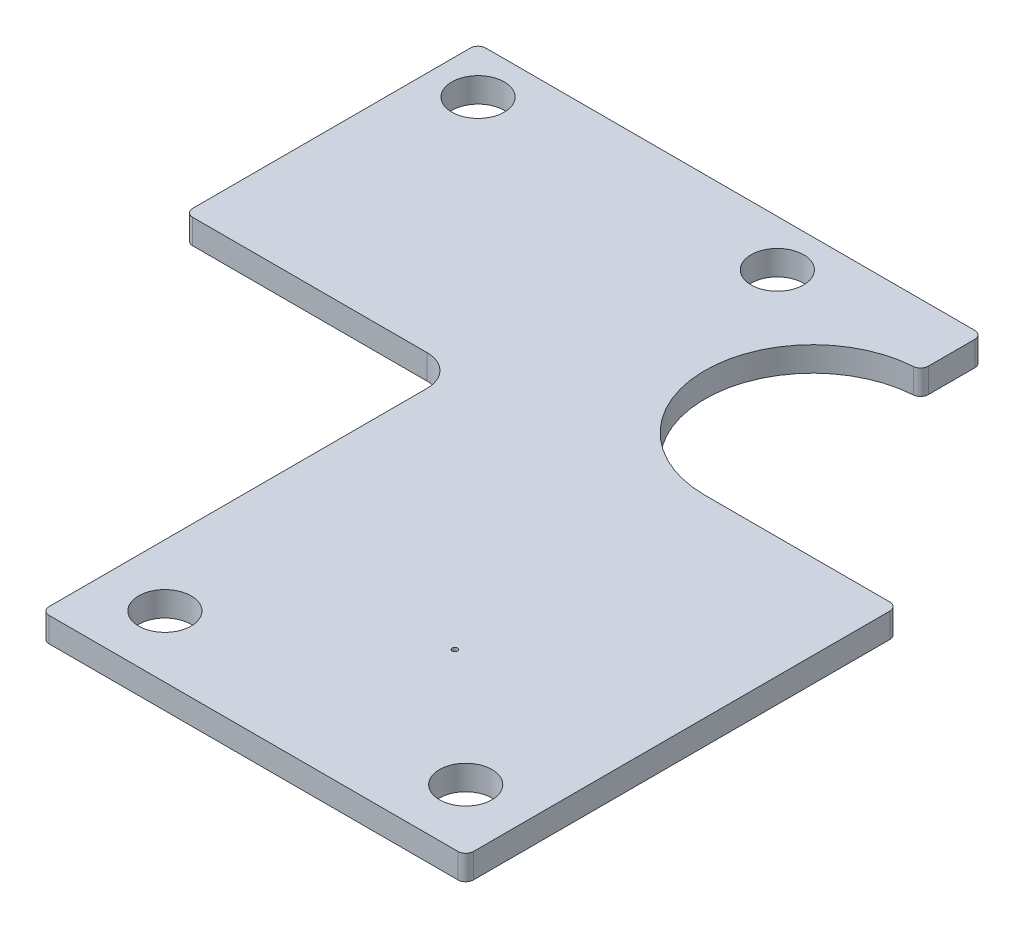
ISO-10303-21;
HEADER;
FILE_DESCRIPTION(('STEP AP214'),'2;1');
FILE_NAME('part.step','',(''),(''),'','','');
FILE_SCHEMA(('AUTOMOTIVE_DESIGN { 1 0 10303 214 1 1 1 1 }'));
ENDSEC;
DATA;
#1=APPLICATION_CONTEXT('core data for automotive mechanical design processes');
#2=APPLICATION_PROTOCOL_DEFINITION('international standard','automotive_design',2000,#1);
#3=PRODUCT_CONTEXT('',#1,'mechanical');
#4=PRODUCT('Part','Part','',(#3));
#5=PRODUCT_RELATED_PRODUCT_CATEGORY('part','',(#4));
#6=PRODUCT_DEFINITION_FORMATION('','',#4);
#7=PRODUCT_DEFINITION_CONTEXT('part definition',#1,'design');
#8=PRODUCT_DEFINITION('design','',#6,#7);
#9=PRODUCT_DEFINITION_SHAPE('','',#8);
#10=(LENGTH_UNIT() NAMED_UNIT(*) SI_UNIT(.MILLI.,.METRE.));
#11=(NAMED_UNIT(*) PLANE_ANGLE_UNIT() SI_UNIT($,.RADIAN.));
#12=(NAMED_UNIT(*) SI_UNIT($,.STERADIAN.) SOLID_ANGLE_UNIT());
#13=UNCERTAINTY_MEASURE_WITH_UNIT(LENGTH_MEASURE(1.E-05),#10,'distance_accuracy_value','');
#14=(GEOMETRIC_REPRESENTATION_CONTEXT(3) GLOBAL_UNCERTAINTY_ASSIGNED_CONTEXT((#13)) GLOBAL_UNIT_ASSIGNED_CONTEXT((#10,
#11,#12)) REPRESENTATION_CONTEXT('',''));
#15=CARTESIAN_POINT('',(0.,0.,0.));
#16=DIRECTION('',(0.,0.,1.));
#17=DIRECTION('',(1.,0.,0.));
#18=AXIS2_PLACEMENT_3D('',#15,#16,#17);
#19=CARTESIAN_POINT('',(0.0325532906366478,1.6,-51.5900827922994));
#20=DIRECTION('',(0.,0.,1.));
#21=DIRECTION('',(1.,0.,0.));
#22=AXIS2_PLACEMENT_3D('',#19,#20,#21);
#23=PLANE('',#22);
#24=DIRECTION('',(-1.,0.,0.));
#25=VECTOR('',#24,1.);
#26=CARTESIAN_POINT('',(0.0325532906366478,0.,-51.5900827922994));
#27=LINE('',#26,#25);
#28=CARTESIAN_POINT('',(32.2325532906362,0.,-51.5900827922994));
#29=VERTEX_POINT('',#28);
#30=CARTESIAN_POINT('',(0.532553290636648,0.,-51.5900827922994));
#31=VERTEX_POINT('',#30);
#32=EDGE_CURVE('E185',#29,#31,#27,.T.);
#33=ORIENTED_EDGE('',*,*,#32,.T.);
#34=DIRECTION('',(0.,-1.,0.));
#35=VECTOR('',#34,1.);
#36=CARTESIAN_POINT('',(0.532553290636648,1.6,-51.5900827922994));
#37=LINE('',#36,#35);
#38=CARTESIAN_POINT('',(0.532553290636648,1.6,-51.5900827922994));
#39=VERTEX_POINT('',#38);
#40=EDGE_CURVE('E250',#31,#39,#37,.F.);
#41=ORIENTED_EDGE('',*,*,#40,.T.);
#42=DIRECTION('',(-1.,0.,0.));
#43=VECTOR('',#42,1.);
#44=CARTESIAN_POINT('',(0.0325532906366478,1.6,-51.5900827922994));
#45=LINE('',#44,#43);
#46=CARTESIAN_POINT('',(32.2325532906362,1.6,-51.5900827922994));
#47=VERTEX_POINT('',#46);
#48=EDGE_CURVE('E207',#47,#39,#45,.T.);
#49=ORIENTED_EDGE('',*,*,#48,.F.);
#50=DIRECTION('',(0.,-1.,0.));
#51=VECTOR('',#50,1.);
#52=CARTESIAN_POINT('',(32.2325532906362,1.6,-51.5900827922994));
#53=LINE('',#52,#51);
#54=EDGE_CURVE('E247',#47,#29,#53,.T.);
#55=ORIENTED_EDGE('',*,*,#54,.T.);
#56=EDGE_LOOP('',(#33,#41,#49,#55));
#57=FACE_BOUND('',#56,.T.);
#58=ADVANCED_FACE('F33',(#57),#23,.F.);
#59=CARTESIAN_POINT('',(0.0325532906366478,1.6,-32.5900827922994));
#60=DIRECTION('',(1.,0.,0.));
#61=DIRECTION('',(0.,0.,-1.));
#62=AXIS2_PLACEMENT_3D('',#59,#60,#61);
#63=PLANE('',#62);
#64=DIRECTION('',(0.,0.,1.));
#65=VECTOR('',#64,1.);
#66=CARTESIAN_POINT('',(0.0325532906366478,1.6,-32.5900827922994));
#67=LINE('',#66,#65);
#68=CARTESIAN_POINT('',(0.0325532906366478,1.6,-51.0900827922994));
#69=VERTEX_POINT('',#68);
#70=CARTESIAN_POINT('',(0.0325532906366478,1.6,-33.0900827922994));
#71=VERTEX_POINT('',#70);
#72=EDGE_CURVE('E300',#69,#71,#67,.T.);
#73=ORIENTED_EDGE('',*,*,#72,.F.);
#74=DIRECTION('',(0.,-1.,0.));
#75=VECTOR('',#74,1.);
#76=CARTESIAN_POINT('',(0.0325532906366478,1.6,-51.0900827922994));
#77=LINE('',#76,#75);
#78=CARTESIAN_POINT('',(0.0325532906366478,0.,-51.0900827922994));
#79=VERTEX_POINT('',#78);
#80=EDGE_CURVE('E244',#69,#79,#77,.T.);
#81=ORIENTED_EDGE('',*,*,#80,.T.);
#82=DIRECTION('',(0.,0.,1.));
#83=VECTOR('',#82,1.);
#84=CARTESIAN_POINT('',(0.0325532906366478,0.,-32.5900827922994));
#85=LINE('',#84,#83);
#86=CARTESIAN_POINT('',(0.0325532906366478,0.,-33.0900827922994));
#87=VERTEX_POINT('',#86);
#88=EDGE_CURVE('E188',#79,#87,#85,.T.);
#89=ORIENTED_EDGE('',*,*,#88,.T.);
#90=DIRECTION('',(0.,-1.,0.));
#91=VECTOR('',#90,1.);
#92=CARTESIAN_POINT('',(0.0325532906366478,1.6,-33.0900827922994));
#93=LINE('',#92,#91);
#94=EDGE_CURVE('E242',#87,#71,#93,.F.);
#95=ORIENTED_EDGE('',*,*,#94,.T.);
#96=EDGE_LOOP('',(#73,#81,#89,#95));
#97=FACE_BOUND('',#96,.T.);
#98=ADVANCED_FACE('F371',(#97),#63,.F.);
#99=CARTESIAN_POINT('',(17.7325532906362,1.6,-32.5900827922994));
#100=DIRECTION('',(0.,0.,-1.));
#101=DIRECTION('',(-1.,0.,0.));
#102=AXIS2_PLACEMENT_3D('',#99,#100,#101);
#103=PLANE('',#102);
#104=DIRECTION('',(1.,0.,0.));
#105=VECTOR('',#104,1.);
#106=CARTESIAN_POINT('',(17.7325532906362,0.,-32.5900827922994));
#107=LINE('',#106,#105);
#108=CARTESIAN_POINT('',(0.532553290636648,0.,-32.5900827922994));
#109=VERTEX_POINT('',#108);
#110=CARTESIAN_POINT('',(15.7325532906362,0.,-32.5900827922994));
#111=VERTEX_POINT('',#110);
#112=EDGE_CURVE('E192',#109,#111,#107,.T.);
#113=ORIENTED_EDGE('',*,*,#112,.T.);
#114=DIRECTION('',(0.,-1.,0.));
#115=VECTOR('',#114,1.);
#116=CARTESIAN_POINT('',(15.7325532906362,1.6,-32.5900827922994));
#117=LINE('',#116,#115);
#118=CARTESIAN_POINT('',(15.7325532906362,1.6,-32.5900827922994));
#119=VERTEX_POINT('',#118);
#120=EDGE_CURVE('E54',#111,#119,#117,.F.);
#121=ORIENTED_EDGE('',*,*,#120,.T.);
#122=DIRECTION('',(1.,0.,0.));
#123=VECTOR('',#122,1.);
#124=CARTESIAN_POINT('',(17.7325532906362,1.6,-32.5900827922994));
#125=LINE('',#124,#123);
#126=CARTESIAN_POINT('',(0.532553290636648,1.6,-32.5900827922994));
#127=VERTEX_POINT('',#126);
#128=EDGE_CURVE('E296',#127,#119,#125,.T.);
#129=ORIENTED_EDGE('',*,*,#128,.F.);
#130=DIRECTION('',(0.,-1.,0.));
#131=VECTOR('',#130,1.);
#132=CARTESIAN_POINT('',(0.532553290636648,1.6,-32.5900827922994));
#133=LINE('',#132,#131);
#134=EDGE_CURVE('E252',#127,#109,#133,.T.);
#135=ORIENTED_EDGE('',*,*,#134,.T.);
#136=EDGE_LOOP('',(#113,#121,#129,#135));
#137=FACE_BOUND('',#136,.T.);
#138=ADVANCED_FACE('F377',(#137),#103,.F.);
#139=CARTESIAN_POINT('',(17.7325532906362,1.6,-5.59008279229901));
#140=DIRECTION('',(1.,0.,0.));
#141=DIRECTION('',(0.,0.,-1.));
#142=AXIS2_PLACEMENT_3D('',#139,#140,#141);
#143=PLANE('',#142);
#144=DIRECTION('',(0.,0.,1.));
#145=VECTOR('',#144,1.);
#146=CARTESIAN_POINT('',(17.7325532906362,1.6,-5.59008279229901));
#147=LINE('',#146,#145);
#148=CARTESIAN_POINT('',(17.7325532906362,1.6,-30.5900827922994));
#149=VERTEX_POINT('',#148);
#150=CARTESIAN_POINT('',(17.7325532906362,1.6,-6.09008279229901));
#151=VERTEX_POINT('',#150);
#152=EDGE_CURVE('E277',#149,#151,#147,.T.);
#153=ORIENTED_EDGE('',*,*,#152,.F.);
#154=DIRECTION('',(0.,-1.,0.));
#155=VECTOR('',#154,1.);
#156=CARTESIAN_POINT('',(17.7325532906362,0.,-30.5900827922994));
#157=LINE('',#156,#155);
#158=CARTESIAN_POINT('',(17.7325532906362,0.,-30.5900827922994));
#159=VERTEX_POINT('',#158);
#160=EDGE_CURVE('E270',#149,#159,#157,.T.);
#161=ORIENTED_EDGE('',*,*,#160,.T.);
#162=DIRECTION('',(0.,0.,1.));
#163=VECTOR('',#162,1.);
#164=CARTESIAN_POINT('',(17.7325532906362,0.,-5.59008279229901));
#165=LINE('',#164,#163);
#166=CARTESIAN_POINT('',(17.7325532906362,0.,-6.09008279229901));
#167=VERTEX_POINT('',#166);
#168=EDGE_CURVE('E194',#159,#167,#165,.T.);
#169=ORIENTED_EDGE('',*,*,#168,.T.);
#170=DIRECTION('',(0.,-1.,0.));
#171=VECTOR('',#170,1.);
#172=CARTESIAN_POINT('',(17.7325532906362,1.6,-6.09008279229901));
#173=LINE('',#172,#171);
#174=EDGE_CURVE('E267',#167,#151,#173,.F.);
#175=ORIENTED_EDGE('',*,*,#174,.T.);
#176=EDGE_LOOP('',(#153,#161,#169,#175));
#177=FACE_BOUND('',#176,.T.);
#178=ADVANCED_FACE('F276',(#177),#143,.F.);
#179=CARTESIAN_POINT('',(45.2325532906362,1.6,-5.59008279229901));
#180=DIRECTION('',(0.,0.,-1.));
#181=DIRECTION('',(-1.,0.,0.));
#182=AXIS2_PLACEMENT_3D('',#179,#180,#181);
#183=PLANE('',#182);
#184=DIRECTION('',(1.,0.,0.));
#185=VECTOR('',#184,1.);
#186=CARTESIAN_POINT('',(45.2325532906362,1.6,-5.59008279229901));
#187=LINE('',#186,#185);
#188=CARTESIAN_POINT('',(18.2325532906362,1.6,-5.59008279229901));
#189=VERTEX_POINT('',#188);
#190=CARTESIAN_POINT('',(44.7325532906362,1.6,-5.59008279229901));
#191=VERTEX_POINT('',#190);
#192=EDGE_CURVE('E290',#189,#191,#187,.T.);
#193=ORIENTED_EDGE('',*,*,#192,.F.);
#194=DIRECTION('',(0.,-1.,0.));
#195=VECTOR('',#194,1.);
#196=CARTESIAN_POINT('',(18.2325532906362,1.6,-5.59008279229901));
#197=LINE('',#196,#195);
#198=CARTESIAN_POINT('',(18.2325532906362,0.,-5.59008279229901));
#199=VERTEX_POINT('',#198);
#200=EDGE_CURVE('E264',#189,#199,#197,.T.);
#201=ORIENTED_EDGE('',*,*,#200,.T.);
#202=DIRECTION('',(1.,0.,0.));
#203=VECTOR('',#202,1.);
#204=CARTESIAN_POINT('',(45.2325532906362,0.,-5.59008279229901));
#205=LINE('',#204,#203);
#206=CARTESIAN_POINT('',(44.7325532906362,0.,-5.59008279229901));
#207=VERTEX_POINT('',#206);
#208=EDGE_CURVE('E196',#199,#207,#205,.T.);
#209=ORIENTED_EDGE('',*,*,#208,.T.);
#210=DIRECTION('',(0.,-1.,0.));
#211=VECTOR('',#210,1.);
#212=CARTESIAN_POINT('',(44.7325532906362,1.6,-5.59008279229901));
#213=LINE('',#212,#211);
#214=EDGE_CURVE('E262',#207,#191,#213,.F.);
#215=ORIENTED_EDGE('',*,*,#214,.T.);
#216=EDGE_LOOP('',(#193,#201,#209,#215));
#217=FACE_BOUND('',#216,.T.);
#218=ADVANCED_FACE('F293',(#217),#183,.F.);
#219=CARTESIAN_POINT('',(45.2325532906362,1.6,-33.590082792299));
#220=DIRECTION('',(-1.,0.,0.));
#221=DIRECTION('',(0.,0.,1.));
#222=AXIS2_PLACEMENT_3D('',#219,#220,#221);
#223=PLANE('',#222);
#224=DIRECTION('',(0.,0.,-1.));
#225=VECTOR('',#224,1.);
#226=CARTESIAN_POINT('',(45.2325532906362,0.,-33.590082792299));
#227=LINE('',#226,#225);
#228=CARTESIAN_POINT('',(45.2325532906362,0.,-6.09008279229902));
#229=VERTEX_POINT('',#228);
#230=CARTESIAN_POINT('',(45.2325532906362,0.,-33.090082792299));
#231=VERTEX_POINT('',#230);
#232=EDGE_CURVE('E199',#229,#231,#227,.T.);
#233=ORIENTED_EDGE('',*,*,#232,.T.);
#234=DIRECTION('',(0.,-1.,0.));
#235=VECTOR('',#234,1.);
#236=CARTESIAN_POINT('',(45.2325532906362,1.6,-33.090082792299));
#237=LINE('',#236,#235);
#238=CARTESIAN_POINT('',(45.2325532906362,1.6,-33.090082792299));
#239=VERTEX_POINT('',#238);
#240=EDGE_CURVE('E260',#231,#239,#237,.F.);
#241=ORIENTED_EDGE('',*,*,#240,.T.);
#242=DIRECTION('',(0.,0.,-1.));
#243=VECTOR('',#242,1.);
#244=CARTESIAN_POINT('',(45.2325532906362,1.6,-33.590082792299));
#245=LINE('',#244,#243);
#246=CARTESIAN_POINT('',(45.2325532906362,1.6,-6.09008279229902));
#247=VERTEX_POINT('',#246);
#248=EDGE_CURVE('E164',#247,#239,#245,.T.);
#249=ORIENTED_EDGE('',*,*,#248,.F.);
#250=DIRECTION('',(0.,-1.,0.));
#251=VECTOR('',#250,1.);
#252=CARTESIAN_POINT('',(45.2325532906362,1.6,-6.09008279229901));
#253=LINE('',#252,#251);
#254=EDGE_CURVE('E257',#247,#229,#253,.T.);
#255=ORIENTED_EDGE('',*,*,#254,.T.);
#256=EDGE_LOOP('',(#233,#241,#249,#255));
#257=FACE_BOUND('',#256,.T.);
#258=ADVANCED_FACE('F410',(#257),#223,.F.);
#259=CARTESIAN_POINT('',(32.7325532906362,1.6,-33.590082792299));
#260=DIRECTION('',(0.,0.,1.));
#261=DIRECTION('',(1.,0.,0.));
#262=AXIS2_PLACEMENT_3D('',#259,#260,#261);
#263=PLANE('',#262);
#264=DIRECTION('',(-1.,0.,0.));
#265=VECTOR('',#264,1.);
#266=CARTESIAN_POINT('',(32.7325532906362,1.6,-33.590082792299));
#267=LINE('',#266,#265);
#268=CARTESIAN_POINT('',(44.7325532906362,1.6,-33.590082792299));
#269=VERTEX_POINT('',#268);
#270=CARTESIAN_POINT('',(32.7325532906362,1.6,-33.590082792299));
#271=VERTEX_POINT('',#270);
#272=EDGE_CURVE('E152',#269,#271,#267,.T.);
#273=ORIENTED_EDGE('',*,*,#272,.F.);
#274=DIRECTION('',(0.,-1.,0.));
#275=VECTOR('',#274,1.);
#276=CARTESIAN_POINT('',(44.7325532906362,1.6,-33.590082792299));
#277=LINE('',#276,#275);
#278=CARTESIAN_POINT('',(44.7325532906362,0.,-33.590082792299));
#279=VERTEX_POINT('',#278);
#280=EDGE_CURVE('E255',#269,#279,#277,.T.);
#281=ORIENTED_EDGE('',*,*,#280,.T.);
#282=DIRECTION('',(-1.,0.,0.));
#283=VECTOR('',#282,1.);
#284=CARTESIAN_POINT('',(32.7325532906362,0.,-33.590082792299));
#285=LINE('',#284,#283);
#286=CARTESIAN_POINT('',(32.7325532906362,0.,-33.590082792299));
#287=VERTEX_POINT('',#286);
#288=EDGE_CURVE('E170',#279,#287,#285,.T.);
#289=ORIENTED_EDGE('',*,*,#288,.T.);
#290=DIRECTION('',(0.,-1.,0.));
#291=VECTOR('',#290,1.);
#292=CARTESIAN_POINT('',(32.7325532906362,1.6,-33.590082792299));
#293=LINE('',#292,#291);
#294=EDGE_CURVE('E167',#271,#287,#293,.T.);
#295=ORIENTED_EDGE('',*,*,#294,.F.);
#296=EDGE_LOOP('',(#273,#281,#289,#295));
#297=FACE_BOUND('',#296,.T.);
#298=ADVANCED_FACE('F168',(#297),#263,.F.);
#299=CARTESIAN_POINT('',(32.7325532906362,1.6,-40.590082792299));
#300=DIRECTION('',(0.,-1.,0.));
#301=DIRECTION('',(0.,0.,-1.));
#302=AXIS2_PLACEMENT_3D('',#299,#300,#301);
#303=CYLINDRICAL_SURFACE('',#302,7.);
#304=CARTESIAN_POINT('',(32.7325532906362,0.,-40.590082792299));
#305=DIRECTION('',(0.,-1.,0.));
#306=DIRECTION('',(0.,0.,1.));
#307=AXIS2_PLACEMENT_3D('',#304,#305,#306);
#308=CIRCLE('',#307,7.);
#309=CARTESIAN_POINT('',(32.2658866239696,0.,-47.5745099142771));
#310=VERTEX_POINT('',#309);
#311=EDGE_CURVE('E203',#287,#310,#308,.T.);
#312=ORIENTED_EDGE('',*,*,#311,.T.);
#313=DIRECTION('',(0.,-1.,0.));
#314=VECTOR('',#313,1.);
#315=CARTESIAN_POINT('',(32.2658866239696,1.6,-47.5745099142771));
#316=LINE('',#315,#314);
#317=CARTESIAN_POINT('',(32.2658866239696,1.6,-47.5745099142771));
#318=VERTEX_POINT('',#317);
#319=EDGE_CURVE('E179',#310,#318,#316,.F.);
#320=ORIENTED_EDGE('',*,*,#319,.T.);
#321=CARTESIAN_POINT('',(32.7325532906362,1.6,-40.590082792299));
#322=DIRECTION('',(0.,-1.,0.));
#323=DIRECTION('',(0.,0.,1.));
#324=AXIS2_PLACEMENT_3D('',#321,#322,#323);
#325=CIRCLE('',#324,7.);
#326=EDGE_CURVE('E156',#271,#318,#325,.T.);
#327=ORIENTED_EDGE('',*,*,#326,.F.);
#328=ORIENTED_EDGE('',*,*,#294,.T.);
#329=EDGE_LOOP('',(#312,#320,#327,#328));
#330=FACE_BOUND('',#329,.T.);
#331=ADVANCED_FACE('F177',(#330),#303,.F.);
#332=CARTESIAN_POINT('',(32.7325532906362,1.6,-47.590082792299));
#333=DIRECTION('',(-1.,0.,0.));
#334=DIRECTION('',(0.,0.,1.));
#335=AXIS2_PLACEMENT_3D('',#332,#333,#334);
#336=PLANE('',#335);
#337=DIRECTION('',(0.,0.,-1.));
#338=VECTOR('',#337,1.);
#339=CARTESIAN_POINT('',(32.7325532906362,1.6,-47.590082792299));
#340=LINE('',#339,#338);
#341=CARTESIAN_POINT('',(32.7325532906362,1.6,-48.0733975658469));
#342=VERTEX_POINT('',#341);
#343=CARTESIAN_POINT('',(32.7325532906362,1.6,-51.0900827922994));
#344=VERTEX_POINT('',#343);
#345=EDGE_CURVE('E175',#342,#344,#340,.T.);
#346=ORIENTED_EDGE('',*,*,#345,.F.);
#347=DIRECTION('',(0.,-1.,0.));
#348=VECTOR('',#347,1.);
#349=CARTESIAN_POINT('',(32.7325532906362,1.6,-48.0733975658469));
#350=LINE('',#349,#348);
#351=CARTESIAN_POINT('',(32.7325532906362,0.,-48.0733975658469));
#352=VERTEX_POINT('',#351);
#353=EDGE_CURVE('E210',#342,#352,#350,.T.);
#354=ORIENTED_EDGE('',*,*,#353,.T.);
#355=DIRECTION('',(0.,0.,-1.));
#356=VECTOR('',#355,1.);
#357=CARTESIAN_POINT('',(32.7325532906362,0.,-47.590082792299));
#358=LINE('',#357,#356);
#359=CARTESIAN_POINT('',(32.7325532906362,0.,-51.0900827922994));
#360=VERTEX_POINT('',#359);
#361=EDGE_CURVE('E205',#352,#360,#358,.T.);
#362=ORIENTED_EDGE('',*,*,#361,.T.);
#363=DIRECTION('',(0.,-1.,0.));
#364=VECTOR('',#363,1.);
#365=CARTESIAN_POINT('',(32.7325532906362,1.6,-51.0900827922994));
#366=LINE('',#365,#364);
#367=EDGE_CURVE('E174',#360,#344,#366,.F.);
#368=ORIENTED_EDGE('',*,*,#367,.T.);
#369=EDGE_LOOP('',(#346,#354,#362,#368));
#370=FACE_BOUND('',#369,.T.);
#371=ADVANCED_FACE('F346',(#370),#336,.F.);
#372=CARTESIAN_POINT('',(32.7325532906362,1.6,-40.590082792299));
#373=DIRECTION('',(0.,1.,0.));
#374=DIRECTION('',(0.,0.,1.));
#375=AXIS2_PLACEMENT_3D('',#372,#373,#374);
#376=PLANE('',#375);
#377=CARTESIAN_POINT('',(33.2975578252259,1.6,-16.8250782577094));
#378=DIRECTION('',(0.,1.,0.));
#379=DIRECTION('',(0.,0.,1.));
#380=AXIS2_PLACEMENT_3D('',#377,#378,#379);
#381=CIRCLE('',#380,0.174999999999996);
#382=CARTESIAN_POINT('',(33.2975578252259,1.6,-16.6500782577094));
#383=VERTEX_POINT('',#382);
#384=EDGE_CURVE('E329',#383,#383,#381,.T.);
#385=ORIENTED_EDGE('',*,*,#384,.F.);
#386=EDGE_LOOP('',(#385));
#387=FACE_BOUND('',#386,.T.);
#388=CARTESIAN_POINT('',(3.03255329063665,1.6,-48.5900827922994));
#389=DIRECTION('',(0.,1.,0.));
#390=DIRECTION('',(0.,0.,1.));
#391=AXIS2_PLACEMENT_3D('',#388,#389,#390);
#392=CIRCLE('',#391,1.7);
#393=CARTESIAN_POINT('',(3.03255329063665,1.6,-46.8900827922994));
#394=VERTEX_POINT('',#393);
#395=EDGE_CURVE('E325',#394,#394,#392,.T.);
#396=ORIENTED_EDGE('',*,*,#395,.F.);
#397=EDGE_LOOP('',(#396));
#398=FACE_BOUND('',#397,.T.);
#399=CARTESIAN_POINT('',(22.4325532906366,1.6,-48.5900827922994));
#400=DIRECTION('',(0.,1.,0.));
#401=DIRECTION('',(0.,0.,1.));
#402=AXIS2_PLACEMENT_3D('',#399,#400,#401);
#403=CIRCLE('',#402,1.7);
#404=CARTESIAN_POINT('',(22.4325532906366,1.6,-46.8900827922994));
#405=VERTEX_POINT('',#404);
#406=EDGE_CURVE('E319',#405,#405,#403,.T.);
#407=ORIENTED_EDGE('',*,*,#406,.F.);
#408=EDGE_LOOP('',(#407));
#409=FACE_BOUND('',#408,.T.);
#410=CARTESIAN_POINT('',(21.7325532906362,1.6,-9.59008279229901));
#411=DIRECTION('',(0.,1.,0.));
#412=DIRECTION('',(0.,0.,1.));
#413=AXIS2_PLACEMENT_3D('',#410,#411,#412);
#414=CIRCLE('',#413,1.7);
#415=CARTESIAN_POINT('',(21.7325532906362,1.6,-7.89008279229901));
#416=VERTEX_POINT('',#415);
#417=EDGE_CURVE('E313',#416,#416,#414,.T.);
#418=ORIENTED_EDGE('',*,*,#417,.F.);
#419=EDGE_LOOP('',(#418));
#420=FACE_BOUND('',#419,.T.);
#421=CARTESIAN_POINT('',(41.2325532906362,1.6,-9.59008279229901));
#422=DIRECTION('',(0.,1.,0.));
#423=DIRECTION('',(0.,0.,1.));
#424=AXIS2_PLACEMENT_3D('',#421,#422,#423);
#425=CIRCLE('',#424,1.7);
#426=CARTESIAN_POINT('',(41.2325532906362,1.6,-7.89008279229901));
#427=VERTEX_POINT('',#426);
#428=EDGE_CURVE('E307',#427,#427,#425,.T.);
#429=ORIENTED_EDGE('',*,*,#428,.F.);
#430=EDGE_LOOP('',(#429));
#431=FACE_BOUND('',#430,.T.);
#432=ORIENTED_EDGE('',*,*,#326,.T.);
#433=CARTESIAN_POINT('',(32.2325532906362,1.6,-48.0733975658469));
#434=DIRECTION('',(0.,1.,0.));
#435=DIRECTION('',(0.,0.,1.));
#436=AXIS2_PLACEMENT_3D('',#433,#434,#435);
#437=CIRCLE('',#436,0.5);
#438=EDGE_CURVE('E240',#318,#342,#437,.T.);
#439=ORIENTED_EDGE('',*,*,#438,.T.);
#440=ORIENTED_EDGE('',*,*,#345,.T.);
#441=CARTESIAN_POINT('',(32.2325532906362,1.6,-51.0900827922994));
#442=DIRECTION('',(0.,1.,0.));
#443=DIRECTION('',(0.,0.,1.));
#444=AXIS2_PLACEMENT_3D('',#441,#442,#443);
#445=CIRCLE('',#444,0.5);
#446=EDGE_CURVE('E234',#344,#47,#445,.T.);
#447=ORIENTED_EDGE('',*,*,#446,.T.);
#448=ORIENTED_EDGE('',*,*,#48,.T.);
#449=CARTESIAN_POINT('',(0.532553290636648,1.6,-51.0900827922994));
#450=DIRECTION('',(0.,1.,0.));
#451=DIRECTION('',(0.,0.,1.));
#452=AXIS2_PLACEMENT_3D('',#449,#450,#451);
#453=CIRCLE('',#452,0.5);
#454=EDGE_CURVE('E238',#39,#69,#453,.T.);
#455=ORIENTED_EDGE('',*,*,#454,.T.);
#456=ORIENTED_EDGE('',*,*,#72,.T.);
#457=CARTESIAN_POINT('',(0.532553290636648,1.6,-33.0900827922994));
#458=DIRECTION('',(0.,1.,0.));
#459=DIRECTION('',(0.,0.,1.));
#460=AXIS2_PLACEMENT_3D('',#457,#458,#459);
#461=CIRCLE('',#460,0.5);
#462=EDGE_CURVE('E236',#71,#127,#461,.T.);
#463=ORIENTED_EDGE('',*,*,#462,.T.);
#464=ORIENTED_EDGE('',*,*,#128,.T.);
#465=CARTESIAN_POINT('',(15.7325532906362,1.6,-30.5900827922994));
#466=DIRECTION('',(0.,1.,0.));
#467=DIRECTION('',(0.,0.,1.));
#468=AXIS2_PLACEMENT_3D('',#465,#466,#467);
#469=CIRCLE('',#468,2.);
#470=EDGE_CURVE('E11',#119,#149,#469,.F.);
#471=ORIENTED_EDGE('',*,*,#470,.T.);
#472=ORIENTED_EDGE('',*,*,#152,.T.);
#473=CARTESIAN_POINT('',(18.2325532906362,1.6,-6.09008279229901));
#474=DIRECTION('',(0.,1.,0.));
#475=DIRECTION('',(0.,0.,1.));
#476=AXIS2_PLACEMENT_3D('',#473,#474,#475);
#477=CIRCLE('',#476,0.5);
#478=EDGE_CURVE('E231',#151,#189,#477,.T.);
#479=ORIENTED_EDGE('',*,*,#478,.T.);
#480=ORIENTED_EDGE('',*,*,#192,.T.);
#481=CARTESIAN_POINT('',(44.7325532906362,1.6,-6.09008279229901));
#482=DIRECTION('',(0.,1.,0.));
#483=DIRECTION('',(0.,0.,1.));
#484=AXIS2_PLACEMENT_3D('',#481,#482,#483);
#485=CIRCLE('',#484,0.5);
#486=EDGE_CURVE('E229',#191,#247,#485,.T.);
#487=ORIENTED_EDGE('',*,*,#486,.T.);
#488=ORIENTED_EDGE('',*,*,#248,.T.);
#489=CARTESIAN_POINT('',(44.7325532906362,1.6,-33.090082792299));
#490=DIRECTION('',(0.,1.,0.));
#491=DIRECTION('',(0.,0.,1.));
#492=AXIS2_PLACEMENT_3D('',#489,#490,#491);
#493=CIRCLE('',#492,0.5);
#494=EDGE_CURVE('E160',#239,#269,#493,.T.);
#495=ORIENTED_EDGE('',*,*,#494,.T.);
#496=ORIENTED_EDGE('',*,*,#272,.T.);
#497=EDGE_LOOP('',(#432,#439,#440,#447,#448,#455,#456,#463,#464,#471,#472,#479,#480,#487,#488,
#495,#496));
#498=FACE_BOUND('',#497,.T.);
#499=ADVANCED_FACE('F154',(#387,#398,#409,#420,#431,#498),#376,.T.);
#500=CARTESIAN_POINT('',(32.7325532906362,0.,-40.590082792299));
#501=DIRECTION('',(0.,1.,0.));
#502=DIRECTION('',(0.,0.,1.));
#503=AXIS2_PLACEMENT_3D('',#500,#501,#502);
#504=PLANE('',#503);
#505=CARTESIAN_POINT('',(33.2975578252259,0.,-16.8250782577094));
#506=DIRECTION('',(0.,1.,0.));
#507=DIRECTION('',(0.,0.,1.));
#508=AXIS2_PLACEMENT_3D('',#505,#506,#507);
#509=CIRCLE('',#508,0.174999999999996);
#510=CARTESIAN_POINT('',(33.2975578252259,0.,-16.6500782577094));
#511=VERTEX_POINT('',#510);
#512=EDGE_CURVE('E328',#511,#511,#509,.T.);
#513=ORIENTED_EDGE('',*,*,#512,.T.);
#514=EDGE_LOOP('',(#513));
#515=FACE_BOUND('',#514,.T.);
#516=CARTESIAN_POINT('',(3.03255329063665,0.,-48.5900827922994));
#517=DIRECTION('',(0.,1.,0.));
#518=DIRECTION('',(0.,0.,1.));
#519=AXIS2_PLACEMENT_3D('',#516,#517,#518);
#520=CIRCLE('',#519,1.7);
#521=CARTESIAN_POINT('',(3.03255329063665,0.,-46.8900827922994));
#522=VERTEX_POINT('',#521);
#523=EDGE_CURVE('E322',#522,#522,#520,.T.);
#524=ORIENTED_EDGE('',*,*,#523,.T.);
#525=EDGE_LOOP('',(#524));
#526=FACE_BOUND('',#525,.T.);
#527=CARTESIAN_POINT('',(22.4325532906366,0.,-48.5900827922994));
#528=DIRECTION('',(0.,1.,0.));
#529=DIRECTION('',(0.,0.,1.));
#530=AXIS2_PLACEMENT_3D('',#527,#528,#529);
#531=CIRCLE('',#530,1.7);
#532=CARTESIAN_POINT('',(22.4325532906366,0.,-46.8900827922994));
#533=VERTEX_POINT('',#532);
#534=EDGE_CURVE('E316',#533,#533,#531,.T.);
#535=ORIENTED_EDGE('',*,*,#534,.T.);
#536=EDGE_LOOP('',(#535));
#537=FACE_BOUND('',#536,.T.);
#538=CARTESIAN_POINT('',(21.7325532906362,0.,-9.59008279229901));
#539=DIRECTION('',(0.,1.,0.));
#540=DIRECTION('',(0.,0.,1.));
#541=AXIS2_PLACEMENT_3D('',#538,#539,#540);
#542=CIRCLE('',#541,1.7);
#543=CARTESIAN_POINT('',(21.7325532906362,0.,-7.89008279229901));
#544=VERTEX_POINT('',#543);
#545=EDGE_CURVE('E310',#544,#544,#542,.T.);
#546=ORIENTED_EDGE('',*,*,#545,.T.);
#547=EDGE_LOOP('',(#546));
#548=FACE_BOUND('',#547,.T.);
#549=CARTESIAN_POINT('',(41.2325532906362,0.,-9.59008279229901));
#550=DIRECTION('',(0.,1.,0.));
#551=DIRECTION('',(0.,0.,1.));
#552=AXIS2_PLACEMENT_3D('',#549,#550,#551);
#553=CIRCLE('',#552,1.7);
#554=CARTESIAN_POINT('',(41.2325532906362,0.,-7.89008279229901));
#555=VERTEX_POINT('',#554);
#556=EDGE_CURVE('E189',#555,#555,#553,.T.);
#557=ORIENTED_EDGE('',*,*,#556,.T.);
#558=EDGE_LOOP('',(#557));
#559=FACE_BOUND('',#558,.T.);
#560=ORIENTED_EDGE('',*,*,#361,.F.);
#561=CARTESIAN_POINT('',(32.2325532906362,0.,-48.0733975658469));
#562=DIRECTION('',(0.,1.,0.));
#563=DIRECTION('',(0.,0.,1.));
#564=AXIS2_PLACEMENT_3D('',#561,#562,#563);
#565=CIRCLE('',#564,0.5);
#566=EDGE_CURVE('E226',#352,#310,#565,.F.);
#567=ORIENTED_EDGE('',*,*,#566,.T.);
#568=ORIENTED_EDGE('',*,*,#311,.F.);
#569=ORIENTED_EDGE('',*,*,#288,.F.);
#570=CARTESIAN_POINT('',(44.7325532906362,0.,-33.090082792299));
#571=DIRECTION('',(0.,1.,0.));
#572=DIRECTION('',(0.,0.,1.));
#573=AXIS2_PLACEMENT_3D('',#570,#571,#572);
#574=CIRCLE('',#573,0.5);
#575=EDGE_CURVE('E218',#279,#231,#574,.F.);
#576=ORIENTED_EDGE('',*,*,#575,.T.);
#577=ORIENTED_EDGE('',*,*,#232,.F.);
#578=CARTESIAN_POINT('',(44.7325532906362,0.,-6.09008279229901));
#579=DIRECTION('',(0.,1.,0.));
#580=DIRECTION('',(0.,0.,1.));
#581=AXIS2_PLACEMENT_3D('',#578,#579,#580);
#582=CIRCLE('',#581,0.5);
#583=EDGE_CURVE('E213',#229,#207,#582,.F.);
#584=ORIENTED_EDGE('',*,*,#583,.T.);
#585=ORIENTED_EDGE('',*,*,#208,.F.);
#586=CARTESIAN_POINT('',(18.2325532906362,0.,-6.09008279229901));
#587=DIRECTION('',(0.,1.,0.));
#588=DIRECTION('',(0.,0.,1.));
#589=AXIS2_PLACEMENT_3D('',#586,#587,#588);
#590=CIRCLE('',#589,0.5);
#591=EDGE_CURVE('E215',#199,#167,#590,.F.);
#592=ORIENTED_EDGE('',*,*,#591,.T.);
#593=ORIENTED_EDGE('',*,*,#168,.F.);
#594=CARTESIAN_POINT('',(15.7325532906362,0.,-30.5900827922994));
#595=DIRECTION('',(0.,1.,0.));
#596=DIRECTION('',(0.,0.,1.));
#597=AXIS2_PLACEMENT_3D('',#594,#595,#596);
#598=CIRCLE('',#597,2.);
#599=EDGE_CURVE('E41',#159,#111,#598,.T.);
#600=ORIENTED_EDGE('',*,*,#599,.T.);
#601=ORIENTED_EDGE('',*,*,#112,.F.);
#602=CARTESIAN_POINT('',(0.532553290636648,0.,-33.0900827922994));
#603=DIRECTION('',(0.,1.,0.));
#604=DIRECTION('',(0.,0.,1.));
#605=AXIS2_PLACEMENT_3D('',#602,#603,#604);
#606=CIRCLE('',#605,0.5);
#607=EDGE_CURVE('E222',#109,#87,#606,.F.);
#608=ORIENTED_EDGE('',*,*,#607,.T.);
#609=ORIENTED_EDGE('',*,*,#88,.F.);
#610=CARTESIAN_POINT('',(0.532553290636648,0.,-51.0900827922994));
#611=DIRECTION('',(0.,1.,0.));
#612=DIRECTION('',(0.,0.,1.));
#613=AXIS2_PLACEMENT_3D('',#610,#611,#612);
#614=CIRCLE('',#613,0.5);
#615=EDGE_CURVE('E224',#79,#31,#614,.F.);
#616=ORIENTED_EDGE('',*,*,#615,.T.);
#617=ORIENTED_EDGE('',*,*,#32,.F.);
#618=CARTESIAN_POINT('',(32.2325532906362,0.,-51.0900827922994));
#619=DIRECTION('',(0.,1.,0.));
#620=DIRECTION('',(0.,0.,1.));
#621=AXIS2_PLACEMENT_3D('',#618,#619,#620);
#622=CIRCLE('',#621,0.5);
#623=EDGE_CURVE('E220',#29,#360,#622,.F.);
#624=ORIENTED_EDGE('',*,*,#623,.T.);
#625=EDGE_LOOP('',(#560,#567,#568,#569,#576,#577,#584,#585,#592,#593,#600,#601,#608,#609,#616,
#617,#624));
#626=FACE_BOUND('',#625,.T.);
#627=ADVANCED_FACE('F281',(#515,#526,#537,#548,#559,#626),#504,.F.);
#628=CARTESIAN_POINT('',(32.2325532906362,1.6,-48.0733975658469));
#629=DIRECTION('',(0.,-1.,0.));
#630=DIRECTION('',(0.,0.,-1.));
#631=AXIS2_PLACEMENT_3D('',#628,#629,#630);
#632=CYLINDRICAL_SURFACE('',#631,0.5);
#633=ORIENTED_EDGE('',*,*,#438,.F.);
#634=ORIENTED_EDGE('',*,*,#319,.F.);
#635=ORIENTED_EDGE('',*,*,#566,.F.);
#636=ORIENTED_EDGE('',*,*,#353,.F.);
#637=EDGE_LOOP('',(#633,#634,#635,#636));
#638=FACE_BOUND('',#637,.T.);
#639=ADVANCED_FACE('F382',(#638),#632,.T.);
#640=CARTESIAN_POINT('',(0.532553290636648,1.6,-51.0900827922994));
#641=DIRECTION('',(0.,-1.,0.));
#642=DIRECTION('',(0.,0.,-1.));
#643=AXIS2_PLACEMENT_3D('',#640,#641,#642);
#644=CYLINDRICAL_SURFACE('',#643,0.5);
#645=ORIENTED_EDGE('',*,*,#454,.F.);
#646=ORIENTED_EDGE('',*,*,#40,.F.);
#647=ORIENTED_EDGE('',*,*,#615,.F.);
#648=ORIENTED_EDGE('',*,*,#80,.F.);
#649=EDGE_LOOP('',(#645,#646,#647,#648));
#650=FACE_BOUND('',#649,.T.);
#651=ADVANCED_FACE('F385',(#650),#644,.T.);
#652=CARTESIAN_POINT('',(0.532553290636648,1.6,-33.0900827922994));
#653=DIRECTION('',(0.,-1.,0.));
#654=DIRECTION('',(0.,0.,-1.));
#655=AXIS2_PLACEMENT_3D('',#652,#653,#654);
#656=CYLINDRICAL_SURFACE('',#655,0.5);
#657=ORIENTED_EDGE('',*,*,#462,.F.);
#658=ORIENTED_EDGE('',*,*,#94,.F.);
#659=ORIENTED_EDGE('',*,*,#607,.F.);
#660=ORIENTED_EDGE('',*,*,#134,.F.);
#661=EDGE_LOOP('',(#657,#658,#659,#660));
#662=FACE_BOUND('',#661,.T.);
#663=ADVANCED_FACE('F389',(#662),#656,.T.);
#664=CARTESIAN_POINT('',(32.2325532906362,1.6,-51.0900827922994));
#665=DIRECTION('',(0.,-1.,0.));
#666=DIRECTION('',(0.,0.,-1.));
#667=AXIS2_PLACEMENT_3D('',#664,#665,#666);
#668=CYLINDRICAL_SURFACE('',#667,0.5);
#669=ORIENTED_EDGE('',*,*,#446,.F.);
#670=ORIENTED_EDGE('',*,*,#367,.F.);
#671=ORIENTED_EDGE('',*,*,#623,.F.);
#672=ORIENTED_EDGE('',*,*,#54,.F.);
#673=EDGE_LOOP('',(#669,#670,#671,#672));
#674=FACE_BOUND('',#673,.T.);
#675=ADVANCED_FACE('F393',(#674),#668,.T.);
#676=CARTESIAN_POINT('',(44.7325532906362,1.6,-33.090082792299));
#677=DIRECTION('',(0.,-1.,0.));
#678=DIRECTION('',(0.,0.,-1.));
#679=AXIS2_PLACEMENT_3D('',#676,#677,#678);
#680=CYLINDRICAL_SURFACE('',#679,0.5);
#681=ORIENTED_EDGE('',*,*,#494,.F.);
#682=ORIENTED_EDGE('',*,*,#240,.F.);
#683=ORIENTED_EDGE('',*,*,#575,.F.);
#684=ORIENTED_EDGE('',*,*,#280,.F.);
#685=EDGE_LOOP('',(#681,#682,#683,#684));
#686=FACE_BOUND('',#685,.T.);
#687=ADVANCED_FACE('F397',(#686),#680,.T.);
#688=CARTESIAN_POINT('',(18.2325532906362,1.6,-6.09008279229901));
#689=DIRECTION('',(0.,-1.,0.));
#690=DIRECTION('',(0.,0.,-1.));
#691=AXIS2_PLACEMENT_3D('',#688,#689,#690);
#692=CYLINDRICAL_SURFACE('',#691,0.5);
#693=ORIENTED_EDGE('',*,*,#478,.F.);
#694=ORIENTED_EDGE('',*,*,#174,.F.);
#695=ORIENTED_EDGE('',*,*,#591,.F.);
#696=ORIENTED_EDGE('',*,*,#200,.F.);
#697=EDGE_LOOP('',(#693,#694,#695,#696));
#698=FACE_BOUND('',#697,.T.);
#699=ADVANCED_FACE('F287',(#698),#692,.T.);
#700=CARTESIAN_POINT('',(44.7325532906362,1.6,-6.09008279229901));
#701=DIRECTION('',(0.,-1.,0.));
#702=DIRECTION('',(0.,0.,-1.));
#703=AXIS2_PLACEMENT_3D('',#700,#701,#702);
#704=CYLINDRICAL_SURFACE('',#703,0.5);
#705=ORIENTED_EDGE('',*,*,#486,.F.);
#706=ORIENTED_EDGE('',*,*,#214,.F.);
#707=ORIENTED_EDGE('',*,*,#583,.F.);
#708=ORIENTED_EDGE('',*,*,#254,.F.);
#709=EDGE_LOOP('',(#705,#706,#707,#708));
#710=FACE_BOUND('',#709,.T.);
#711=ADVANCED_FACE('F368',(#710),#704,.T.);
#712=CARTESIAN_POINT('',(15.7325532906362,1.6,-30.5900827922994));
#713=DIRECTION('',(0.,1.,0.));
#714=DIRECTION('',(0.,0.,1.));
#715=AXIS2_PLACEMENT_3D('',#712,#713,#714);
#716=CYLINDRICAL_SURFACE('',#715,2.);
#717=ORIENTED_EDGE('',*,*,#470,.F.);
#718=ORIENTED_EDGE('',*,*,#120,.F.);
#719=ORIENTED_EDGE('',*,*,#599,.F.);
#720=ORIENTED_EDGE('',*,*,#160,.F.);
#721=EDGE_LOOP('',(#717,#718,#719,#720));
#722=FACE_BOUND('',#721,.T.);
#723=ADVANCED_FACE('F35',(#722),#716,.F.);
#724=CARTESIAN_POINT('',(41.2325532906362,1.6,-9.59008279229901));
#725=DIRECTION('',(0.,1.,0.));
#726=DIRECTION('',(0.,0.,1.));
#727=AXIS2_PLACEMENT_3D('',#724,#725,#726);
#728=CYLINDRICAL_SURFACE('',#727,1.7);
#729=ORIENTED_EDGE('',*,*,#556,.F.);
#730=EDGE_LOOP('',(#729));
#731=FACE_BOUND('',#730,.T.);
#732=ORIENTED_EDGE('',*,*,#428,.T.);
#733=EDGE_LOOP('',(#732));
#734=FACE_BOUND('',#733,.T.);
#735=ADVANCED_FACE('F356',(#731,#734),#728,.F.);
#736=CARTESIAN_POINT('',(21.7325532906362,1.6,-9.59008279229901));
#737=DIRECTION('',(0.,1.,0.));
#738=DIRECTION('',(0.,0.,1.));
#739=AXIS2_PLACEMENT_3D('',#736,#737,#738);
#740=CYLINDRICAL_SURFACE('',#739,1.7);
#741=ORIENTED_EDGE('',*,*,#545,.F.);
#742=EDGE_LOOP('',(#741));
#743=FACE_BOUND('',#742,.T.);
#744=ORIENTED_EDGE('',*,*,#417,.T.);
#745=EDGE_LOOP('',(#744));
#746=FACE_BOUND('',#745,.T.);
#747=ADVANCED_FACE('F358',(#743,#746),#740,.F.);
#748=CARTESIAN_POINT('',(22.4325532906366,1.6,-48.5900827922994));
#749=DIRECTION('',(0.,1.,0.));
#750=DIRECTION('',(0.,0.,1.));
#751=AXIS2_PLACEMENT_3D('',#748,#749,#750);
#752=CYLINDRICAL_SURFACE('',#751,1.7);
#753=ORIENTED_EDGE('',*,*,#534,.F.);
#754=EDGE_LOOP('',(#753));
#755=FACE_BOUND('',#754,.T.);
#756=ORIENTED_EDGE('',*,*,#406,.T.);
#757=EDGE_LOOP('',(#756));
#758=FACE_BOUND('',#757,.T.);
#759=ADVANCED_FACE('F365',(#755,#758),#752,.F.);
#760=CARTESIAN_POINT('',(3.03255329063665,1.6,-48.5900827922994));
#761=DIRECTION('',(0.,1.,0.));
#762=DIRECTION('',(0.,0.,1.));
#763=AXIS2_PLACEMENT_3D('',#760,#761,#762);
#764=CYLINDRICAL_SURFACE('',#763,1.7);
#765=ORIENTED_EDGE('',*,*,#523,.F.);
#766=EDGE_LOOP('',(#765));
#767=FACE_BOUND('',#766,.T.);
#768=ORIENTED_EDGE('',*,*,#395,.T.);
#769=EDGE_LOOP('',(#768));
#770=FACE_BOUND('',#769,.T.);
#771=ADVANCED_FACE('F340',(#767,#770),#764,.F.);
#772=CARTESIAN_POINT('',(33.2975578252259,0.,-16.8250782577094));
#773=DIRECTION('',(0.,1.,0.));
#774=DIRECTION('',(0.,0.,1.));
#775=AXIS2_PLACEMENT_3D('',#772,#773,#774);
#776=CYLINDRICAL_SURFACE('',#775,0.174999999999996);
#777=ORIENTED_EDGE('',*,*,#512,.F.);
#778=EDGE_LOOP('',(#777));
#779=FACE_BOUND('',#778,.T.);
#780=ORIENTED_EDGE('',*,*,#384,.T.);
#781=EDGE_LOOP('',(#780));
#782=FACE_BOUND('',#781,.T.);
#783=ADVANCED_FACE('F337',(#779,#782),#776,.F.);
#784=CLOSED_SHELL('',(#58,#98,#138,#178,#218,#258,#298,#331,#371,#499,#627,#639,#651,#663,#675,
#687,#699,#711,#723,#735,#747,#759,#771,#783));
#785=MANIFOLD_SOLID_BREP('B2',#784);
#786=ADVANCED_BREP_SHAPE_REPRESENTATION('',(#18,#785),#14);
#787=SHAPE_DEFINITION_REPRESENTATION(#9,#786);
ENDSEC;
END-ISO-10303-21;
